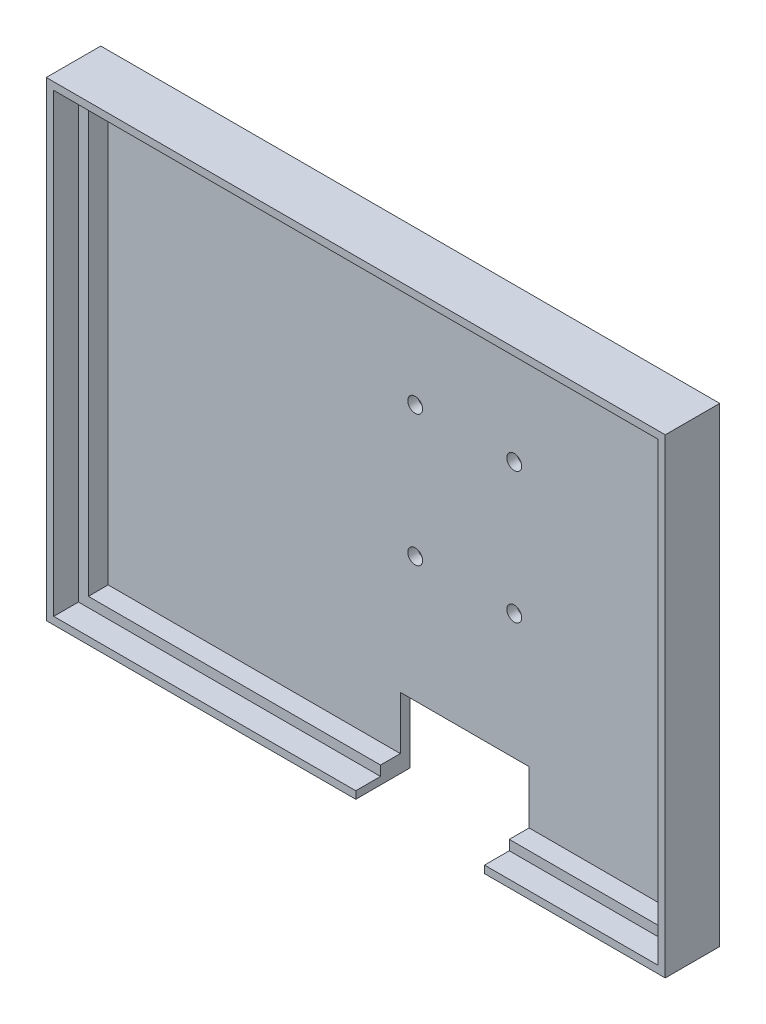
ISO-10303-21;
HEADER;
FILE_DESCRIPTION(('STEP AP214'),'2;1');
FILE_NAME('part.step','',(''),(''),'','','');
FILE_SCHEMA(('AUTOMOTIVE_DESIGN { 1 0 10303 214 1 1 1 1 }'));
ENDSEC;
DATA;
#1=APPLICATION_CONTEXT('core data for automotive mechanical design processes');
#2=APPLICATION_PROTOCOL_DEFINITION('international standard','automotive_design',2000,#1);
#3=PRODUCT_CONTEXT('',#1,'mechanical');
#4=PRODUCT('Part','Part','',(#3));
#5=PRODUCT_RELATED_PRODUCT_CATEGORY('part','',(#4));
#6=PRODUCT_DEFINITION_FORMATION('','',#4);
#7=PRODUCT_DEFINITION_CONTEXT('part definition',#1,'design');
#8=PRODUCT_DEFINITION('design','',#6,#7);
#9=PRODUCT_DEFINITION_SHAPE('','',#8);
#10=(LENGTH_UNIT() NAMED_UNIT(*) SI_UNIT(.MILLI.,.METRE.));
#11=(NAMED_UNIT(*) PLANE_ANGLE_UNIT() SI_UNIT($,.RADIAN.));
#12=(NAMED_UNIT(*) SI_UNIT($,.STERADIAN.) SOLID_ANGLE_UNIT());
#13=UNCERTAINTY_MEASURE_WITH_UNIT(LENGTH_MEASURE(1.E-05),#10,'distance_accuracy_value','');
#14=(GEOMETRIC_REPRESENTATION_CONTEXT(3) GLOBAL_UNCERTAINTY_ASSIGNED_CONTEXT((#13)) GLOBAL_UNIT_ASSIGNED_CONTEXT((#10,
#11,#12)) REPRESENTATION_CONTEXT('',''));
#15=CARTESIAN_POINT('',(0.,0.,0.));
#16=DIRECTION('',(0.,0.,1.));
#17=DIRECTION('',(1.,0.,0.));
#18=AXIS2_PLACEMENT_3D('',#15,#16,#17);
#19=CARTESIAN_POINT('',(-59.,-44.,4.));
#20=DIRECTION('',(0.,1.,0.));
#21=DIRECTION('',(0.,0.,1.));
#22=AXIS2_PLACEMENT_3D('',#19,#20,#21);
#23=PLANE('',#22);
#24=DIRECTION('',(0.,0.,1.));
#25=VECTOR('',#24,1.);
#26=CARTESIAN_POINT('',(0.,-44.,4.));
#27=LINE('',#26,#25);
#28=CARTESIAN_POINT('',(0.,-44.,0.));
#29=VERTEX_POINT('',#28);
#30=CARTESIAN_POINT('',(0.,-44.,4.));
#31=VERTEX_POINT('',#30);
#32=EDGE_CURVE('E242',#29,#31,#27,.T.);
#33=ORIENTED_EDGE('',*,*,#32,.F.);
#34=DIRECTION('',(1.,0.,0.));
#35=VECTOR('',#34,1.);
#36=CARTESIAN_POINT('',(-59.,-44.,0.));
#37=LINE('',#36,#35);
#38=CARTESIAN_POINT('',(-59.,-44.,0.));
#39=VERTEX_POINT('',#38);
#40=EDGE_CURVE('E347',#39,#29,#37,.T.);
#41=ORIENTED_EDGE('',*,*,#40,.F.);
#42=DIRECTION('',(0.,0.,-1.));
#43=VECTOR('',#42,1.);
#44=CARTESIAN_POINT('',(-59.,-44.,4.));
#45=LINE('',#44,#43);
#46=CARTESIAN_POINT('',(-59.,-44.,4.));
#47=VERTEX_POINT('',#46);
#48=EDGE_CURVE('E355',#47,#39,#45,.T.);
#49=ORIENTED_EDGE('',*,*,#48,.F.);
#50=DIRECTION('',(1.,0.,0.));
#51=VECTOR('',#50,1.);
#52=CARTESIAN_POINT('',(-59.,-44.,4.));
#53=LINE('',#52,#51);
#54=EDGE_CURVE('E335',#47,#31,#53,.T.);
#55=ORIENTED_EDGE('',*,*,#54,.T.);
#56=EDGE_LOOP('',(#33,#41,#49,#55));
#57=FACE_BOUND('',#56,.T.);
#58=ADVANCED_FACE('F61',(#57),#23,.T.);
#59=CARTESIAN_POINT('',(61.,-46.,9.));
#60=DIRECTION('',(0.,1.,0.));
#61=DIRECTION('',(-1.,0.,0.));
#62=AXIS2_PLACEMENT_3D('',#59,#60,#61);
#63=PLANE('',#62);
#64=DIRECTION('',(0.,0.,1.));
#65=VECTOR('',#64,1.);
#66=CARTESIAN_POINT('',(0.,-46.,9.));
#67=LINE('',#66,#65);
#68=CARTESIAN_POINT('',(0.,-46.,4.));
#69=VERTEX_POINT('',#68);
#70=CARTESIAN_POINT('',(0.,-46.,9.));
#71=VERTEX_POINT('',#70);
#72=EDGE_CURVE('E235',#69,#71,#67,.T.);
#73=ORIENTED_EDGE('',*,*,#72,.F.);
#74=DIRECTION('',(1.,0.,0.));
#75=VECTOR('',#74,1.);
#76=CARTESIAN_POINT('',(61.,-46.,4.));
#77=LINE('',#76,#75);
#78=CARTESIAN_POINT('',(-61.,-46.,4.));
#79=VERTEX_POINT('',#78);
#80=EDGE_CURVE('E286',#79,#69,#77,.T.);
#81=ORIENTED_EDGE('',*,*,#80,.F.);
#82=DIRECTION('',(0.,0.,-1.));
#83=VECTOR('',#82,1.);
#84=CARTESIAN_POINT('',(-61.,-46.,9.));
#85=LINE('',#84,#83);
#86=CARTESIAN_POINT('',(-61.,-46.,9.));
#87=VERTEX_POINT('',#86);
#88=EDGE_CURVE('E299',#87,#79,#85,.T.);
#89=ORIENTED_EDGE('',*,*,#88,.F.);
#90=DIRECTION('',(1.,0.,0.));
#91=VECTOR('',#90,1.);
#92=CARTESIAN_POINT('',(61.,-46.,9.));
#93=LINE('',#92,#91);
#94=EDGE_CURVE('E275',#87,#71,#93,.T.);
#95=ORIENTED_EDGE('',*,*,#94,.T.);
#96=EDGE_LOOP('',(#73,#81,#89,#95));
#97=FACE_BOUND('',#96,.T.);
#98=ADVANCED_FACE('F425',(#97),#63,.T.);
#99=CARTESIAN_POINT('',(-62.5,-47.5,4.));
#100=DIRECTION('',(0.,1.,0.));
#101=DIRECTION('',(0.,0.,1.));
#102=AXIS2_PLACEMENT_3D('',#99,#100,#101);
#103=PLANE('',#102);
#104=DIRECTION('',(-1.,0.,0.));
#105=VECTOR('',#104,1.);
#106=CARTESIAN_POINT('',(62.5,-47.5,-2.));
#107=LINE('',#106,#105);
#108=CARTESIAN_POINT('',(0.,-47.5,-2.));
#109=VERTEX_POINT('',#108);
#110=CARTESIAN_POINT('',(-62.5,-47.5,-2.));
#111=VERTEX_POINT('',#110);
#112=EDGE_CURVE('E324',#109,#111,#107,.T.);
#113=ORIENTED_EDGE('',*,*,#112,.F.);
#114=DIRECTION('',(0.,0.,1.));
#115=VECTOR('',#114,1.);
#116=CARTESIAN_POINT('',(0.,-47.5,4.));
#117=LINE('',#116,#115);
#118=CARTESIAN_POINT('',(0.,-47.5,9.));
#119=VERTEX_POINT('',#118);
#120=EDGE_CURVE('E12',#109,#119,#117,.T.);
#121=ORIENTED_EDGE('',*,*,#120,.T.);
#122=DIRECTION('',(1.,0.,0.));
#123=VECTOR('',#122,1.);
#124=CARTESIAN_POINT('',(-62.5,-47.5,9.));
#125=LINE('',#124,#123);
#126=CARTESIAN_POINT('',(-62.5,-47.5,9.));
#127=VERTEX_POINT('',#126);
#128=EDGE_CURVE('E312',#127,#119,#125,.T.);
#129=ORIENTED_EDGE('',*,*,#128,.F.);
#130=DIRECTION('',(0.,0.,-1.));
#131=VECTOR('',#130,1.);
#132=CARTESIAN_POINT('',(-62.5,-47.5,4.));
#133=LINE('',#132,#131);
#134=EDGE_CURVE('E364',#127,#111,#133,.T.);
#135=ORIENTED_EDGE('',*,*,#134,.T.);
#136=EDGE_LOOP('',(#113,#121,#129,#135));
#137=FACE_BOUND('',#136,.T.);
#138=ADVANCED_FACE('F434',(#137),#103,.F.);
#139=CARTESIAN_POINT('',(0.,0.,0.));
#140=DIRECTION('',(0.,0.,1.));
#141=DIRECTION('',(1.,0.,0.));
#142=AXIS2_PLACEMENT_3D('',#139,#140,#141);
#143=PLANE('',#142);
#144=DIRECTION('',(0.,-1.,0.));
#145=VECTOR('',#144,1.);
#146=CARTESIAN_POINT('',(0.,0.,0.));
#147=LINE('',#146,#145);
#148=CARTESIAN_POINT('',(0.,-33.287424432803,0.));
#149=VERTEX_POINT('',#148);
#150=EDGE_CURVE('E244',#149,#29,#147,.T.);
#151=ORIENTED_EDGE('',*,*,#150,.F.);
#152=DIRECTION('',(-1.,0.,0.));
#153=VECTOR('',#152,1.);
#154=CARTESIAN_POINT('',(0.,-33.287424432803,0.));
#155=LINE('',#154,#153);
#156=CARTESIAN_POINT('',(26.,-33.287424432803,0.));
#157=VERTEX_POINT('',#156);
#158=EDGE_CURVE('E206',#157,#149,#155,.T.);
#159=ORIENTED_EDGE('',*,*,#158,.F.);
#160=DIRECTION('',(0.,1.,0.));
#161=VECTOR('',#160,1.);
#162=CARTESIAN_POINT('',(26.,0.,0.));
#163=LINE('',#162,#161);
#164=CARTESIAN_POINT('',(26.,-44.,0.));
#165=VERTEX_POINT('',#164);
#166=EDGE_CURVE('E233',#165,#157,#163,.T.);
#167=ORIENTED_EDGE('',*,*,#166,.F.);
#168=CARTESIAN_POINT('',(59.,-44.,0.));
#169=VERTEX_POINT('',#168);
#170=EDGE_CURVE('E346',#165,#169,#37,.T.);
#171=ORIENTED_EDGE('',*,*,#170,.T.);
#172=DIRECTION('',(0.,1.,0.));
#173=VECTOR('',#172,1.);
#174=CARTESIAN_POINT('',(59.,-44.,0.));
#175=LINE('',#174,#173);
#176=CARTESIAN_POINT('',(59.,44.,0.));
#177=VERTEX_POINT('',#176);
#178=EDGE_CURVE('E343',#169,#177,#175,.T.);
#179=ORIENTED_EDGE('',*,*,#178,.T.);
#180=DIRECTION('',(1.,0.,0.));
#181=VECTOR('',#180,1.);
#182=CARTESIAN_POINT('',(-59.,44.,0.));
#183=LINE('',#182,#181);
#184=CARTESIAN_POINT('',(-59.,44.,0.));
#185=VERTEX_POINT('',#184);
#186=EDGE_CURVE('E327',#185,#177,#183,.T.);
#187=ORIENTED_EDGE('',*,*,#186,.F.);
#188=DIRECTION('',(0.,1.,0.));
#189=VECTOR('',#188,1.);
#190=CARTESIAN_POINT('',(-59.,-44.,0.));
#191=LINE('',#190,#189);
#192=EDGE_CURVE('E332',#39,#185,#191,.T.);
#193=ORIENTED_EDGE('',*,*,#192,.F.);
#194=ORIENTED_EDGE('',*,*,#40,.T.);
#195=EDGE_LOOP('',(#151,#159,#167,#171,#179,#187,#193,#194));
#196=FACE_BOUND('',#195,.T.);
#197=CARTESIAN_POINT('',(2.99999999999999,-8.,0.));
#198=DIRECTION('',(0.,0.,1.));
#199=DIRECTION('',(1.,0.,0.));
#200=AXIS2_PLACEMENT_3D('',#197,#198,#199);
#201=CIRCLE('',#200,1.5);
#202=CARTESIAN_POINT('',(4.49999999999999,-8.,0.));
#203=VERTEX_POINT('',#202);
#204=EDGE_CURVE('E265',#203,#203,#201,.F.);
#205=ORIENTED_EDGE('',*,*,#204,.T.);
#206=EDGE_LOOP('',(#205));
#207=FACE_BOUND('',#206,.T.);
#208=CARTESIAN_POINT('',(2.99999999999999,18.5,0.));
#209=DIRECTION('',(0.,0.,1.));
#210=DIRECTION('',(1.,0.,0.));
#211=AXIS2_PLACEMENT_3D('',#208,#209,#210);
#212=CIRCLE('',#211,1.5);
#213=CARTESIAN_POINT('',(4.49999999999999,18.5,0.));
#214=VERTEX_POINT('',#213);
#215=EDGE_CURVE('E259',#214,#214,#212,.F.);
#216=ORIENTED_EDGE('',*,*,#215,.T.);
#217=EDGE_LOOP('',(#216));
#218=FACE_BOUND('',#217,.T.);
#219=CARTESIAN_POINT('',(23.,-8.,0.));
#220=DIRECTION('',(0.,0.,1.));
#221=DIRECTION('',(1.,0.,0.));
#222=AXIS2_PLACEMENT_3D('',#219,#220,#221);
#223=CIRCLE('',#222,1.5);
#224=CARTESIAN_POINT('',(24.5,-8.,0.));
#225=VERTEX_POINT('',#224);
#226=EDGE_CURVE('E262',#225,#225,#223,.T.);
#227=ORIENTED_EDGE('',*,*,#226,.F.);
#228=EDGE_LOOP('',(#227));
#229=FACE_BOUND('',#228,.T.);
#230=CARTESIAN_POINT('',(23.,18.5,0.));
#231=DIRECTION('',(0.,0.,1.));
#232=DIRECTION('',(1.,0.,0.));
#233=AXIS2_PLACEMENT_3D('',#230,#231,#232);
#234=CIRCLE('',#233,1.5);
#235=CARTESIAN_POINT('',(24.5,18.5,0.));
#236=VERTEX_POINT('',#235);
#237=EDGE_CURVE('E268',#236,#236,#234,.T.);
#238=ORIENTED_EDGE('',*,*,#237,.F.);
#239=EDGE_LOOP('',(#238));
#240=FACE_BOUND('',#239,.T.);
#241=ADVANCED_FACE('F405',(#196,#207,#218,#229,#240),#143,.T.);
#242=CARTESIAN_POINT('',(0.,0.,-2.));
#243=DIRECTION('',(0.,0.,1.));
#244=DIRECTION('',(1.,0.,0.));
#245=AXIS2_PLACEMENT_3D('',#242,#243,#244);
#246=PLANE('',#245);
#247=CARTESIAN_POINT('',(23.,-8.,-2.));
#248=DIRECTION('',(0.,0.,-1.));
#249=DIRECTION('',(-1.,0.,0.));
#250=AXIS2_PLACEMENT_3D('',#247,#248,#249);
#251=CIRCLE('',#250,1.5);
#252=CARTESIAN_POINT('',(21.5,-8.,-2.));
#253=VERTEX_POINT('',#252);
#254=EDGE_CURVE('E247',#253,#253,#251,.T.);
#255=ORIENTED_EDGE('',*,*,#254,.F.);
#256=EDGE_LOOP('',(#255));
#257=FACE_BOUND('',#256,.T.);
#258=CARTESIAN_POINT('',(2.99999999999999,18.5,-2.));
#259=DIRECTION('',(0.,0.,1.));
#260=DIRECTION('',(1.,0.,0.));
#261=AXIS2_PLACEMENT_3D('',#258,#259,#260);
#262=CIRCLE('',#261,1.5);
#263=CARTESIAN_POINT('',(4.49999999999999,18.5,-2.));
#264=VERTEX_POINT('',#263);
#265=EDGE_CURVE('E254',#264,#264,#262,.T.);
#266=ORIENTED_EDGE('',*,*,#265,.T.);
#267=EDGE_LOOP('',(#266));
#268=FACE_BOUND('',#267,.T.);
#269=DIRECTION('',(1.,0.,0.));
#270=VECTOR('',#269,1.);
#271=CARTESIAN_POINT('',(0.,-33.287424432803,-2.));
#272=LINE('',#271,#270);
#273=CARTESIAN_POINT('',(0.,-33.287424432803,-2.));
#274=VERTEX_POINT('',#273);
#275=CARTESIAN_POINT('',(26.,-33.287424432803,-2.));
#276=VERTEX_POINT('',#275);
#277=EDGE_CURVE('E204',#274,#276,#272,.T.);
#278=ORIENTED_EDGE('',*,*,#277,.F.);
#279=DIRECTION('',(0.,1.,0.));
#280=VECTOR('',#279,1.);
#281=CARTESIAN_POINT('',(0.,-47.5,-2.));
#282=LINE('',#281,#280);
#283=EDGE_CURVE('E212',#109,#274,#282,.T.);
#284=ORIENTED_EDGE('',*,*,#283,.F.);
#285=ORIENTED_EDGE('',*,*,#112,.T.);
#286=DIRECTION('',(0.,1.,0.));
#287=VECTOR('',#286,1.);
#288=CARTESIAN_POINT('',(-62.5,-47.5,-2.));
#289=LINE('',#288,#287);
#290=CARTESIAN_POINT('',(-62.5,47.5,-2.));
#291=VERTEX_POINT('',#290);
#292=EDGE_CURVE('E315',#111,#291,#289,.T.);
#293=ORIENTED_EDGE('',*,*,#292,.T.);
#294=DIRECTION('',(1.,0.,0.));
#295=VECTOR('',#294,1.);
#296=CARTESIAN_POINT('',(62.5,47.5,-2.));
#297=LINE('',#296,#295);
#298=CARTESIAN_POINT('',(62.5,47.5,-2.));
#299=VERTEX_POINT('',#298);
#300=EDGE_CURVE('E318',#291,#299,#297,.T.);
#301=ORIENTED_EDGE('',*,*,#300,.T.);
#302=DIRECTION('',(0.,-1.,0.));
#303=VECTOR('',#302,1.);
#304=CARTESIAN_POINT('',(62.5,-47.5,-2.));
#305=LINE('',#304,#303);
#306=CARTESIAN_POINT('',(62.5,-47.5,-2.));
#307=VERTEX_POINT('',#306);
#308=EDGE_CURVE('E321',#299,#307,#305,.T.);
#309=ORIENTED_EDGE('',*,*,#308,.T.);
#310=CARTESIAN_POINT('',(26.,-47.5,-2.));
#311=VERTEX_POINT('',#310);
#312=EDGE_CURVE('E325',#307,#311,#107,.T.);
#313=ORIENTED_EDGE('',*,*,#312,.T.);
#314=DIRECTION('',(0.,-1.,0.));
#315=VECTOR('',#314,1.);
#316=CARTESIAN_POINT('',(26.,-47.5,-2.));
#317=LINE('',#316,#315);
#318=EDGE_CURVE('E76',#276,#311,#317,.T.);
#319=ORIENTED_EDGE('',*,*,#318,.F.);
#320=EDGE_LOOP('',(#278,#284,#285,#293,#301,#309,#313,#319));
#321=FACE_BOUND('',#320,.T.);
#322=CARTESIAN_POINT('',(2.99999999999999,-8.,-2.));
#323=DIRECTION('',(0.,0.,1.));
#324=DIRECTION('',(1.,0.,0.));
#325=AXIS2_PLACEMENT_3D('',#322,#323,#324);
#326=CIRCLE('',#325,1.5);
#327=CARTESIAN_POINT('',(4.49999999999999,-8.,-2.));
#328=VERTEX_POINT('',#327);
#329=EDGE_CURVE('E250',#328,#328,#326,.T.);
#330=ORIENTED_EDGE('',*,*,#329,.T.);
#331=EDGE_LOOP('',(#330));
#332=FACE_BOUND('',#331,.T.);
#333=CARTESIAN_POINT('',(23.,18.5,-2.));
#334=DIRECTION('',(0.,0.,-1.));
#335=DIRECTION('',(-1.,0.,0.));
#336=AXIS2_PLACEMENT_3D('',#333,#334,#335);
#337=CIRCLE('',#336,1.5);
#338=CARTESIAN_POINT('',(21.5,18.5,-2.));
#339=VERTEX_POINT('',#338);
#340=EDGE_CURVE('E251',#339,#339,#337,.T.);
#341=ORIENTED_EDGE('',*,*,#340,.F.);
#342=EDGE_LOOP('',(#341));
#343=FACE_BOUND('',#342,.T.);
#344=ADVANCED_FACE('F217',(#257,#268,#321,#332,#343),#246,.F.);
#345=CARTESIAN_POINT('',(0.,0.,4.));
#346=DIRECTION('',(0.,0.,1.));
#347=DIRECTION('',(1.,0.,0.));
#348=AXIS2_PLACEMENT_3D('',#345,#346,#347);
#349=PLANE('',#348);
#350=DIRECTION('',(0.,-1.,0.));
#351=VECTOR('',#350,1.);
#352=CARTESIAN_POINT('',(0.,0.,4.));
#353=LINE('',#352,#351);
#354=EDGE_CURVE('E240',#31,#69,#353,.T.);
#355=ORIENTED_EDGE('',*,*,#354,.F.);
#356=ORIENTED_EDGE('',*,*,#54,.F.);
#357=DIRECTION('',(0.,1.,0.));
#358=VECTOR('',#357,1.);
#359=CARTESIAN_POINT('',(-59.,-44.,4.));
#360=LINE('',#359,#358);
#361=CARTESIAN_POINT('',(-59.,44.,4.));
#362=VERTEX_POINT('',#361);
#363=EDGE_CURVE('E338',#47,#362,#360,.T.);
#364=ORIENTED_EDGE('',*,*,#363,.T.);
#365=DIRECTION('',(1.,0.,0.));
#366=VECTOR('',#365,1.);
#367=CARTESIAN_POINT('',(-59.,44.,4.));
#368=LINE('',#367,#366);
#369=CARTESIAN_POINT('',(59.,44.,4.));
#370=VERTEX_POINT('',#369);
#371=EDGE_CURVE('E328',#362,#370,#368,.T.);
#372=ORIENTED_EDGE('',*,*,#371,.T.);
#373=DIRECTION('',(0.,1.,0.));
#374=VECTOR('',#373,1.);
#375=CARTESIAN_POINT('',(59.,-44.,4.));
#376=LINE('',#375,#374);
#377=CARTESIAN_POINT('',(59.,-44.,4.));
#378=VERTEX_POINT('',#377);
#379=EDGE_CURVE('E331',#378,#370,#376,.T.);
#380=ORIENTED_EDGE('',*,*,#379,.F.);
#381=CARTESIAN_POINT('',(26.,-44.,4.));
#382=VERTEX_POINT('',#381);
#383=EDGE_CURVE('E334',#382,#378,#53,.T.);
#384=ORIENTED_EDGE('',*,*,#383,.F.);
#385=DIRECTION('',(0.,1.,0.));
#386=VECTOR('',#385,1.);
#387=CARTESIAN_POINT('',(26.,0.,4.));
#388=LINE('',#387,#386);
#389=CARTESIAN_POINT('',(26.,-46.,4.));
#390=VERTEX_POINT('',#389);
#391=EDGE_CURVE('E229',#390,#382,#388,.T.);
#392=ORIENTED_EDGE('',*,*,#391,.F.);
#393=CARTESIAN_POINT('',(61.,-46.,4.));
#394=VERTEX_POINT('',#393);
#395=EDGE_CURVE('E285',#390,#394,#77,.T.);
#396=ORIENTED_EDGE('',*,*,#395,.T.);
#397=DIRECTION('',(0.,1.,0.));
#398=VECTOR('',#397,1.);
#399=CARTESIAN_POINT('',(61.,-46.,4.));
#400=LINE('',#399,#398);
#401=CARTESIAN_POINT('',(61.,46.,4.));
#402=VERTEX_POINT('',#401);
#403=EDGE_CURVE('E288',#394,#402,#400,.T.);
#404=ORIENTED_EDGE('',*,*,#403,.T.);
#405=DIRECTION('',(-1.,0.,0.));
#406=VECTOR('',#405,1.);
#407=CARTESIAN_POINT('',(61.,46.,4.));
#408=LINE('',#407,#406);
#409=CARTESIAN_POINT('',(-61.,46.,4.));
#410=VERTEX_POINT('',#409);
#411=EDGE_CURVE('E274',#402,#410,#408,.T.);
#412=ORIENTED_EDGE('',*,*,#411,.T.);
#413=DIRECTION('',(0.,-1.,0.));
#414=VECTOR('',#413,1.);
#415=CARTESIAN_POINT('',(-61.,-46.,4.));
#416=LINE('',#415,#414);
#417=EDGE_CURVE('E84',#410,#79,#416,.T.);
#418=ORIENTED_EDGE('',*,*,#417,.T.);
#419=ORIENTED_EDGE('',*,*,#80,.T.);
#420=EDGE_LOOP('',(#355,#356,#364,#372,#380,#384,#392,#396,#404,#412,#418,#419));
#421=FACE_BOUND('',#420,.T.);
#422=ADVANCED_FACE('F394',(#421),#349,.T.);
#423=CARTESIAN_POINT('',(-59.,44.,4.));
#424=DIRECTION('',(0.,1.,0.));
#425=DIRECTION('',(0.,0.,1.));
#426=AXIS2_PLACEMENT_3D('',#423,#424,#425);
#427=PLANE('',#426);
#428=ORIENTED_EDGE('',*,*,#186,.T.);
#429=DIRECTION('',(0.,0.,-1.));
#430=VECTOR('',#429,1.);
#431=CARTESIAN_POINT('',(59.,44.,4.));
#432=LINE('',#431,#430);
#433=EDGE_CURVE('E341',#370,#177,#432,.T.);
#434=ORIENTED_EDGE('',*,*,#433,.F.);
#435=ORIENTED_EDGE('',*,*,#371,.F.);
#436=DIRECTION('',(0.,0.,-1.));
#437=VECTOR('',#436,1.);
#438=CARTESIAN_POINT('',(-59.,44.,4.));
#439=LINE('',#438,#437);
#440=EDGE_CURVE('E352',#362,#185,#439,.T.);
#441=ORIENTED_EDGE('',*,*,#440,.T.);
#442=EDGE_LOOP('',(#428,#434,#435,#441));
#443=FACE_BOUND('',#442,.T.);
#444=ADVANCED_FACE('F413',(#443),#427,.F.);
#445=CARTESIAN_POINT('',(-59.,-44.,4.));
#446=DIRECTION('',(-1.,0.,0.));
#447=DIRECTION('',(0.,0.,1.));
#448=AXIS2_PLACEMENT_3D('',#445,#446,#447);
#449=PLANE('',#448);
#450=ORIENTED_EDGE('',*,*,#192,.T.);
#451=ORIENTED_EDGE('',*,*,#440,.F.);
#452=ORIENTED_EDGE('',*,*,#363,.F.);
#453=ORIENTED_EDGE('',*,*,#48,.T.);
#454=EDGE_LOOP('',(#450,#451,#452,#453));
#455=FACE_BOUND('',#454,.T.);
#456=ADVANCED_FACE('F417',(#455),#449,.F.);
#457=DIRECTION('',(0.,0.,-1.));
#458=VECTOR('',#457,1.);
#459=CARTESIAN_POINT('',(26.,-44.,4.));
#460=LINE('',#459,#458);
#461=EDGE_CURVE('E231',#382,#165,#460,.T.);
#462=ORIENTED_EDGE('',*,*,#461,.F.);
#463=ORIENTED_EDGE('',*,*,#383,.T.);
#464=DIRECTION('',(0.,0.,-1.));
#465=VECTOR('',#464,1.);
#466=CARTESIAN_POINT('',(59.,-44.,4.));
#467=LINE('',#466,#465);
#468=EDGE_CURVE('E357',#378,#169,#467,.T.);
#469=ORIENTED_EDGE('',*,*,#468,.T.);
#470=ORIENTED_EDGE('',*,*,#170,.F.);
#471=EDGE_LOOP('',(#462,#463,#469,#470));
#472=FACE_BOUND('',#471,.T.);
#473=ADVANCED_FACE('F401',(#472),#23,.T.);
#474=CARTESIAN_POINT('',(59.,-44.,4.));
#475=DIRECTION('',(-1.,0.,0.));
#476=DIRECTION('',(0.,0.,1.));
#477=AXIS2_PLACEMENT_3D('',#474,#475,#476);
#478=PLANE('',#477);
#479=ORIENTED_EDGE('',*,*,#178,.F.);
#480=ORIENTED_EDGE('',*,*,#468,.F.);
#481=ORIENTED_EDGE('',*,*,#379,.T.);
#482=ORIENTED_EDGE('',*,*,#433,.T.);
#483=EDGE_LOOP('',(#479,#480,#481,#482));
#484=FACE_BOUND('',#483,.T.);
#485=ADVANCED_FACE('F409',(#484),#478,.T.);
#486=CARTESIAN_POINT('',(0.,0.,9.));
#487=DIRECTION('',(0.,0.,-1.));
#488=DIRECTION('',(-1.,0.,0.));
#489=AXIS2_PLACEMENT_3D('',#486,#487,#488);
#490=PLANE('',#489);
#491=ORIENTED_EDGE('',*,*,#128,.T.);
#492=DIRECTION('',(0.,1.,0.));
#493=VECTOR('',#492,1.);
#494=CARTESIAN_POINT('',(0.,0.,9.));
#495=LINE('',#494,#493);
#496=EDGE_CURVE('E237',#119,#71,#495,.T.);
#497=ORIENTED_EDGE('',*,*,#496,.T.);
#498=ORIENTED_EDGE('',*,*,#94,.F.);
#499=DIRECTION('',(0.,-1.,0.));
#500=VECTOR('',#499,1.);
#501=CARTESIAN_POINT('',(-61.,-46.,9.));
#502=LINE('',#501,#500);
#503=CARTESIAN_POINT('',(-61.,46.,9.));
#504=VERTEX_POINT('',#503);
#505=EDGE_CURVE('E271',#504,#87,#502,.T.);
#506=ORIENTED_EDGE('',*,*,#505,.F.);
#507=DIRECTION('',(-1.,0.,0.));
#508=VECTOR('',#507,1.);
#509=CARTESIAN_POINT('',(61.,46.,9.));
#510=LINE('',#509,#508);
#511=CARTESIAN_POINT('',(61.,46.,9.));
#512=VERTEX_POINT('',#511);
#513=EDGE_CURVE('E281',#512,#504,#510,.T.);
#514=ORIENTED_EDGE('',*,*,#513,.F.);
#515=DIRECTION('',(0.,1.,0.));
#516=VECTOR('',#515,1.);
#517=CARTESIAN_POINT('',(61.,-46.,9.));
#518=LINE('',#517,#516);
#519=CARTESIAN_POINT('',(61.,-46.,9.));
#520=VERTEX_POINT('',#519);
#521=EDGE_CURVE('E278',#520,#512,#518,.T.);
#522=ORIENTED_EDGE('',*,*,#521,.F.);
#523=CARTESIAN_POINT('',(26.,-46.,9.));
#524=VERTEX_POINT('',#523);
#525=EDGE_CURVE('E273',#524,#520,#93,.T.);
#526=ORIENTED_EDGE('',*,*,#525,.F.);
#527=DIRECTION('',(0.,-1.,0.));
#528=VECTOR('',#527,1.);
#529=CARTESIAN_POINT('',(26.,0.,9.));
#530=LINE('',#529,#528);
#531=CARTESIAN_POINT('',(26.,-47.5,9.));
#532=VERTEX_POINT('',#531);
#533=EDGE_CURVE('E226',#524,#532,#530,.T.);
#534=ORIENTED_EDGE('',*,*,#533,.T.);
#535=CARTESIAN_POINT('',(62.5,-47.5,9.));
#536=VERTEX_POINT('',#535);
#537=EDGE_CURVE('E311',#532,#536,#125,.T.);
#538=ORIENTED_EDGE('',*,*,#537,.T.);
#539=DIRECTION('',(0.,1.,0.));
#540=VECTOR('',#539,1.);
#541=CARTESIAN_POINT('',(62.5,-47.5,9.));
#542=LINE('',#541,#540);
#543=CARTESIAN_POINT('',(62.5,47.5,9.));
#544=VERTEX_POINT('',#543);
#545=EDGE_CURVE('E302',#536,#544,#542,.T.);
#546=ORIENTED_EDGE('',*,*,#545,.T.);
#547=DIRECTION('',(-1.,0.,0.));
#548=VECTOR('',#547,1.);
#549=CARTESIAN_POINT('',(-62.5,47.5,9.));
#550=LINE('',#549,#548);
#551=CARTESIAN_POINT('',(-62.5,47.5,9.));
#552=VERTEX_POINT('',#551);
#553=EDGE_CURVE('E305',#544,#552,#550,.T.);
#554=ORIENTED_EDGE('',*,*,#553,.T.);
#555=DIRECTION('',(0.,-1.,0.));
#556=VECTOR('',#555,1.);
#557=CARTESIAN_POINT('',(-62.5,-47.5,9.));
#558=LINE('',#557,#556);
#559=EDGE_CURVE('E308',#552,#127,#558,.T.);
#560=ORIENTED_EDGE('',*,*,#559,.T.);
#561=EDGE_LOOP('',(#491,#497,#498,#506,#514,#522,#526,#534,#538,#546,#554,#560));
#562=FACE_BOUND('',#561,.T.);
#563=ADVANCED_FACE('F381',(#562),#490,.F.);
#564=CARTESIAN_POINT('',(-61.,-46.,9.));
#565=DIRECTION('',(1.,0.,0.));
#566=DIRECTION('',(0.,0.,-1.));
#567=AXIS2_PLACEMENT_3D('',#564,#565,#566);
#568=PLANE('',#567);
#569=ORIENTED_EDGE('',*,*,#417,.F.);
#570=DIRECTION('',(0.,0.,-1.));
#571=VECTOR('',#570,1.);
#572=CARTESIAN_POINT('',(-61.,46.,9.));
#573=LINE('',#572,#571);
#574=EDGE_CURVE('E283',#504,#410,#573,.T.);
#575=ORIENTED_EDGE('',*,*,#574,.F.);
#576=ORIENTED_EDGE('',*,*,#505,.T.);
#577=ORIENTED_EDGE('',*,*,#88,.T.);
#578=EDGE_LOOP('',(#569,#575,#576,#577));
#579=FACE_BOUND('',#578,.T.);
#580=ADVANCED_FACE('F428',(#579),#568,.T.);
#581=DIRECTION('',(0.,0.,-1.));
#582=VECTOR('',#581,1.);
#583=CARTESIAN_POINT('',(26.,-46.,9.));
#584=LINE('',#583,#582);
#585=EDGE_CURVE('E223',#524,#390,#584,.T.);
#586=ORIENTED_EDGE('',*,*,#585,.F.);
#587=ORIENTED_EDGE('',*,*,#525,.T.);
#588=DIRECTION('',(0.,0.,-1.));
#589=VECTOR('',#588,1.);
#590=CARTESIAN_POINT('',(61.,-46.,9.));
#591=LINE('',#590,#589);
#592=EDGE_CURVE('E296',#520,#394,#591,.T.);
#593=ORIENTED_EDGE('',*,*,#592,.T.);
#594=ORIENTED_EDGE('',*,*,#395,.F.);
#595=EDGE_LOOP('',(#586,#587,#593,#594));
#596=FACE_BOUND('',#595,.T.);
#597=ADVANCED_FACE('F390',(#596),#63,.T.);
#598=CARTESIAN_POINT('',(61.,-46.,9.));
#599=DIRECTION('',(-1.,0.,0.));
#600=DIRECTION('',(0.,0.,1.));
#601=AXIS2_PLACEMENT_3D('',#598,#599,#600);
#602=PLANE('',#601);
#603=ORIENTED_EDGE('',*,*,#403,.F.);
#604=ORIENTED_EDGE('',*,*,#592,.F.);
#605=ORIENTED_EDGE('',*,*,#521,.T.);
#606=DIRECTION('',(0.,0.,-1.));
#607=VECTOR('',#606,1.);
#608=CARTESIAN_POINT('',(61.,46.,9.));
#609=LINE('',#608,#607);
#610=EDGE_CURVE('E293',#512,#402,#609,.T.);
#611=ORIENTED_EDGE('',*,*,#610,.T.);
#612=EDGE_LOOP('',(#603,#604,#605,#611));
#613=FACE_BOUND('',#612,.T.);
#614=ADVANCED_FACE('F474',(#613),#602,.T.);
#615=CARTESIAN_POINT('',(61.,46.,9.));
#616=DIRECTION('',(0.,-1.,0.));
#617=DIRECTION('',(1.,0.,0.));
#618=AXIS2_PLACEMENT_3D('',#615,#616,#617);
#619=PLANE('',#618);
#620=ORIENTED_EDGE('',*,*,#411,.F.);
#621=ORIENTED_EDGE('',*,*,#610,.F.);
#622=ORIENTED_EDGE('',*,*,#513,.T.);
#623=ORIENTED_EDGE('',*,*,#574,.T.);
#624=EDGE_LOOP('',(#620,#621,#622,#623));
#625=FACE_BOUND('',#624,.T.);
#626=ADVANCED_FACE('F477',(#625),#619,.T.);
#627=ORIENTED_EDGE('',*,*,#537,.F.);
#628=DIRECTION('',(0.,0.,-1.));
#629=VECTOR('',#628,1.);
#630=CARTESIAN_POINT('',(26.,-47.5,4.));
#631=LINE('',#630,#629);
#632=EDGE_CURVE('E69',#532,#311,#631,.T.);
#633=ORIENTED_EDGE('',*,*,#632,.T.);
#634=ORIENTED_EDGE('',*,*,#312,.F.);
#635=DIRECTION('',(0.,0.,-1.));
#636=VECTOR('',#635,1.);
#637=CARTESIAN_POINT('',(62.5,-47.5,4.));
#638=LINE('',#637,#636);
#639=EDGE_CURVE('E367',#536,#307,#638,.T.);
#640=ORIENTED_EDGE('',*,*,#639,.F.);
#641=EDGE_LOOP('',(#627,#633,#634,#640));
#642=FACE_BOUND('',#641,.T.);
#643=ADVANCED_FACE('F372',(#642),#103,.F.);
#644=CARTESIAN_POINT('',(-62.5,-47.5,4.));
#645=DIRECTION('',(-1.,0.,0.));
#646=DIRECTION('',(0.,0.,1.));
#647=AXIS2_PLACEMENT_3D('',#644,#645,#646);
#648=PLANE('',#647);
#649=DIRECTION('',(0.,0.,-1.));
#650=VECTOR('',#649,1.);
#651=CARTESIAN_POINT('',(-62.5,47.5,4.));
#652=LINE('',#651,#650);
#653=EDGE_CURVE('E362',#552,#291,#652,.T.);
#654=ORIENTED_EDGE('',*,*,#653,.T.);
#655=ORIENTED_EDGE('',*,*,#292,.F.);
#656=ORIENTED_EDGE('',*,*,#134,.F.);
#657=ORIENTED_EDGE('',*,*,#559,.F.);
#658=EDGE_LOOP('',(#654,#655,#656,#657));
#659=FACE_BOUND('',#658,.T.);
#660=ADVANCED_FACE('F437',(#659),#648,.T.);
#661=CARTESIAN_POINT('',(-62.5,47.5,4.));
#662=DIRECTION('',(0.,1.,0.));
#663=DIRECTION('',(0.,0.,1.));
#664=AXIS2_PLACEMENT_3D('',#661,#662,#663);
#665=PLANE('',#664);
#666=DIRECTION('',(0.,0.,-1.));
#667=VECTOR('',#666,1.);
#668=CARTESIAN_POINT('',(62.5,47.5,4.));
#669=LINE('',#668,#667);
#670=EDGE_CURVE('E354',#544,#299,#669,.T.);
#671=ORIENTED_EDGE('',*,*,#670,.T.);
#672=ORIENTED_EDGE('',*,*,#300,.F.);
#673=ORIENTED_EDGE('',*,*,#653,.F.);
#674=ORIENTED_EDGE('',*,*,#553,.F.);
#675=EDGE_LOOP('',(#671,#672,#673,#674));
#676=FACE_BOUND('',#675,.T.);
#677=ADVANCED_FACE('F63',(#676),#665,.T.);
#678=CARTESIAN_POINT('',(62.5,-47.5,4.));
#679=DIRECTION('',(-1.,0.,0.));
#680=DIRECTION('',(0.,0.,1.));
#681=AXIS2_PLACEMENT_3D('',#678,#679,#680);
#682=PLANE('',#681);
#683=ORIENTED_EDGE('',*,*,#639,.T.);
#684=ORIENTED_EDGE('',*,*,#308,.F.);
#685=ORIENTED_EDGE('',*,*,#670,.F.);
#686=ORIENTED_EDGE('',*,*,#545,.F.);
#687=EDGE_LOOP('',(#683,#684,#685,#686));
#688=FACE_BOUND('',#687,.T.);
#689=ADVANCED_FACE('F377',(#688),#682,.F.);
#690=CARTESIAN_POINT('',(2.99999999999999,18.5,24.5));
#691=DIRECTION('',(0.,0.,-1.));
#692=DIRECTION('',(-1.,0.,0.));
#693=AXIS2_PLACEMENT_3D('',#690,#691,#692);
#694=CYLINDRICAL_SURFACE('',#693,1.5);
#695=ORIENTED_EDGE('',*,*,#215,.F.);
#696=EDGE_LOOP('',(#695));
#697=FACE_BOUND('',#696,.T.);
#698=ORIENTED_EDGE('',*,*,#265,.F.);
#699=EDGE_LOOP('',(#698));
#700=FACE_BOUND('',#699,.T.);
#701=ADVANCED_FACE('F444',(#697,#700),#694,.F.);
#702=CARTESIAN_POINT('',(23.,-8.,24.5));
#703=DIRECTION('',(0.,0.,-1.));
#704=DIRECTION('',(-1.,0.,0.));
#705=AXIS2_PLACEMENT_3D('',#702,#703,#704);
#706=CYLINDRICAL_SURFACE('',#705,1.5);
#707=ORIENTED_EDGE('',*,*,#226,.T.);
#708=EDGE_LOOP('',(#707));
#709=FACE_BOUND('',#708,.T.);
#710=ORIENTED_EDGE('',*,*,#254,.T.);
#711=EDGE_LOOP('',(#710));
#712=FACE_BOUND('',#711,.T.);
#713=ADVANCED_FACE('F484',(#709,#712),#706,.F.);
#714=CARTESIAN_POINT('',(2.99999999999999,-8.,24.5));
#715=DIRECTION('',(0.,0.,-1.));
#716=DIRECTION('',(-1.,0.,0.));
#717=AXIS2_PLACEMENT_3D('',#714,#715,#716);
#718=CYLINDRICAL_SURFACE('',#717,1.5);
#719=ORIENTED_EDGE('',*,*,#204,.F.);
#720=EDGE_LOOP('',(#719));
#721=FACE_BOUND('',#720,.T.);
#722=ORIENTED_EDGE('',*,*,#329,.F.);
#723=EDGE_LOOP('',(#722));
#724=FACE_BOUND('',#723,.T.);
#725=ADVANCED_FACE('F486',(#721,#724),#718,.F.);
#726=CARTESIAN_POINT('',(23.,18.5,24.5));
#727=DIRECTION('',(0.,0.,-1.));
#728=DIRECTION('',(-1.,0.,0.));
#729=AXIS2_PLACEMENT_3D('',#726,#727,#728);
#730=CYLINDRICAL_SURFACE('',#729,1.5);
#731=ORIENTED_EDGE('',*,*,#237,.T.);
#732=EDGE_LOOP('',(#731));
#733=FACE_BOUND('',#732,.T.);
#734=ORIENTED_EDGE('',*,*,#340,.T.);
#735=EDGE_LOOP('',(#734));
#736=FACE_BOUND('',#735,.T.);
#737=ADVANCED_FACE('F489',(#733,#736),#730,.F.);
#738=CARTESIAN_POINT('',(0.,-47.5,24.5));
#739=DIRECTION('',(-1.,0.,0.));
#740=DIRECTION('',(0.,0.,1.));
#741=AXIS2_PLACEMENT_3D('',#738,#739,#740);
#742=PLANE('',#741);
#743=ORIENTED_EDGE('',*,*,#150,.T.);
#744=ORIENTED_EDGE('',*,*,#32,.T.);
#745=ORIENTED_EDGE('',*,*,#354,.T.);
#746=ORIENTED_EDGE('',*,*,#72,.T.);
#747=ORIENTED_EDGE('',*,*,#496,.F.);
#748=ORIENTED_EDGE('',*,*,#120,.F.);
#749=ORIENTED_EDGE('',*,*,#283,.T.);
#750=DIRECTION('',(0.,0.,-1.));
#751=VECTOR('',#750,1.);
#752=CARTESIAN_POINT('',(0.,-33.287424432803,24.5));
#753=LINE('',#752,#751);
#754=EDGE_CURVE('E199',#149,#274,#753,.T.);
#755=ORIENTED_EDGE('',*,*,#754,.F.);
#756=EDGE_LOOP('',(#743,#744,#745,#746,#747,#748,#749,#755));
#757=FACE_BOUND('',#756,.T.);
#758=ADVANCED_FACE('F213',(#757),#742,.F.);
#759=CARTESIAN_POINT('',(26.,-47.5,24.5));
#760=DIRECTION('',(1.,0.,0.));
#761=DIRECTION('',(0.,0.,-1.));
#762=AXIS2_PLACEMENT_3D('',#759,#760,#761);
#763=PLANE('',#762);
#764=ORIENTED_EDGE('',*,*,#166,.T.);
#765=DIRECTION('',(0.,0.,-1.));
#766=VECTOR('',#765,1.);
#767=CARTESIAN_POINT('',(26.,-33.287424432803,24.5));
#768=LINE('',#767,#766);
#769=EDGE_CURVE('E209',#157,#276,#768,.T.);
#770=ORIENTED_EDGE('',*,*,#769,.T.);
#771=ORIENTED_EDGE('',*,*,#318,.T.);
#772=ORIENTED_EDGE('',*,*,#632,.F.);
#773=ORIENTED_EDGE('',*,*,#533,.F.);
#774=ORIENTED_EDGE('',*,*,#585,.T.);
#775=ORIENTED_EDGE('',*,*,#391,.T.);
#776=ORIENTED_EDGE('',*,*,#461,.T.);
#777=EDGE_LOOP('',(#764,#770,#771,#772,#773,#774,#775,#776));
#778=FACE_BOUND('',#777,.T.);
#779=ADVANCED_FACE('F386',(#778),#763,.F.);
#780=CARTESIAN_POINT('',(0.,-33.287424432803,24.5));
#781=DIRECTION('',(0.,1.,0.));
#782=DIRECTION('',(0.,0.,1.));
#783=AXIS2_PLACEMENT_3D('',#780,#781,#782);
#784=PLANE('',#783);
#785=ORIENTED_EDGE('',*,*,#158,.T.);
#786=ORIENTED_EDGE('',*,*,#754,.T.);
#787=ORIENTED_EDGE('',*,*,#277,.T.);
#788=ORIENTED_EDGE('',*,*,#769,.F.);
#789=EDGE_LOOP('',(#785,#786,#787,#788));
#790=FACE_BOUND('',#789,.T.);
#791=ADVANCED_FACE('F201',(#790),#784,.F.);
#792=CLOSED_SHELL('',(#58,#98,#138,#241,#344,#422,#444,#456,#473,#485,#563,#580,#597,#614,#626,
#643,#660,#677,#689,#701,#713,#725,#737,#758,#779,#791));
#793=MANIFOLD_SOLID_BREP('B2',#792);
#794=ADVANCED_BREP_SHAPE_REPRESENTATION('',(#18,#793),#14);
#795=SHAPE_DEFINITION_REPRESENTATION(#9,#794);
ENDSEC;
END-ISO-10303-21;
